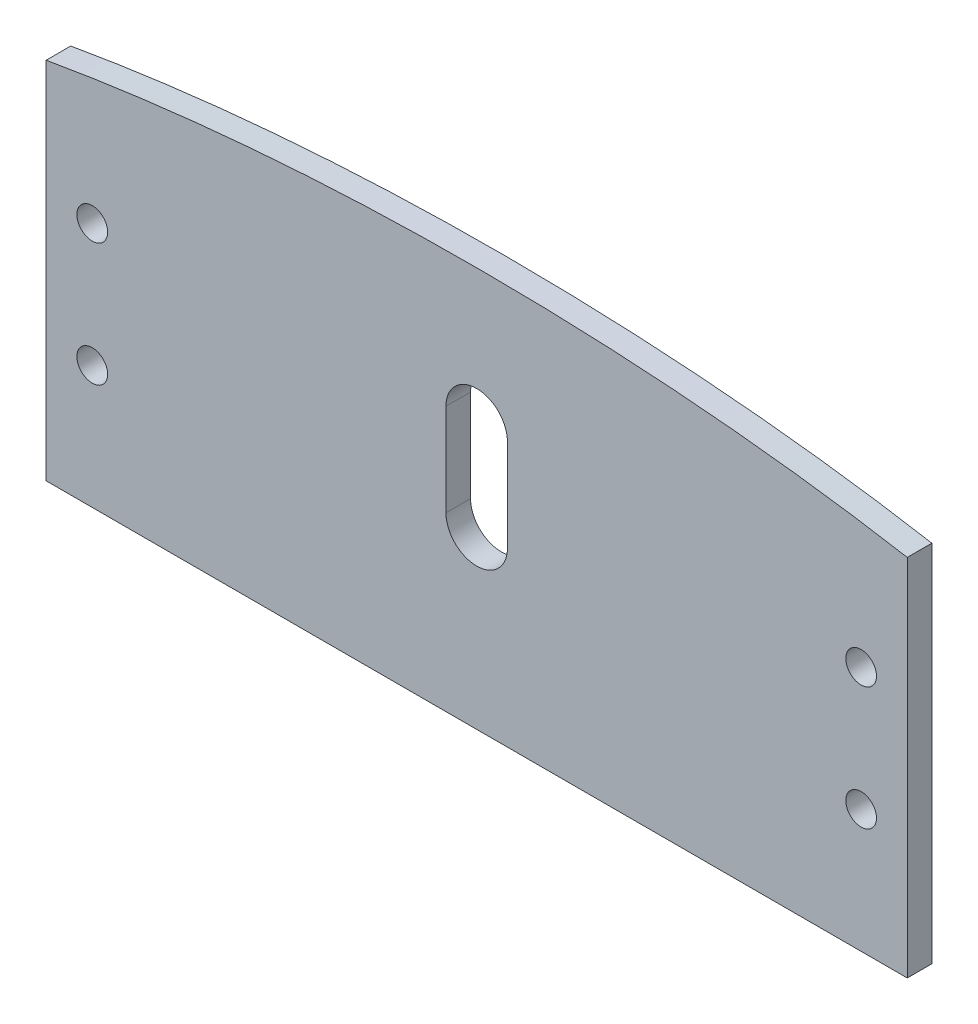
ISO-10303-21;
HEADER;
FILE_DESCRIPTION(('STEP AP214'),'2;1');
FILE_NAME('part.step','',(''),(''),'','','');
FILE_SCHEMA(('AUTOMOTIVE_DESIGN { 1 0 10303 214 1 1 1 1 }'));
ENDSEC;
DATA;
#1=APPLICATION_CONTEXT('core data for automotive mechanical design processes');
#2=APPLICATION_PROTOCOL_DEFINITION('international standard','automotive_design',2000,#1);
#3=PRODUCT_CONTEXT('',#1,'mechanical');
#4=PRODUCT('Part','Part','',(#3));
#5=PRODUCT_RELATED_PRODUCT_CATEGORY('part','',(#4));
#6=PRODUCT_DEFINITION_FORMATION('','',#4);
#7=PRODUCT_DEFINITION_CONTEXT('part definition',#1,'design');
#8=PRODUCT_DEFINITION('design','',#6,#7);
#9=PRODUCT_DEFINITION_SHAPE('','',#8);
#10=(LENGTH_UNIT() NAMED_UNIT(*) SI_UNIT(.MILLI.,.METRE.));
#11=(NAMED_UNIT(*) PLANE_ANGLE_UNIT() SI_UNIT($,.RADIAN.));
#12=(NAMED_UNIT(*) SI_UNIT($,.STERADIAN.) SOLID_ANGLE_UNIT());
#13=UNCERTAINTY_MEASURE_WITH_UNIT(LENGTH_MEASURE(1.E-05),#10,'distance_accuracy_value','');
#14=(GEOMETRIC_REPRESENTATION_CONTEXT(3) GLOBAL_UNCERTAINTY_ASSIGNED_CONTEXT((#13)) GLOBAL_UNIT_ASSIGNED_CONTEXT((#10,
#11,#12)) REPRESENTATION_CONTEXT('',''));
#15=CARTESIAN_POINT('',(0.,0.,0.));
#16=DIRECTION('',(0.,0.,1.));
#17=DIRECTION('',(1.,0.,0.));
#18=AXIS2_PLACEMENT_3D('',#15,#16,#17);
#19=CARTESIAN_POINT('',(70.,0.,0.));
#20=DIRECTION('',(-1.,0.,0.));
#21=DIRECTION('',(0.,-1.,0.));
#22=AXIS2_PLACEMENT_3D('',#19,#20,#21);
#23=PLANE('',#22);
#24=DIRECTION('',(0.,0.,-1.));
#25=VECTOR('',#24,1.);
#26=CARTESIAN_POINT('',(70.,44.2216638714053,4.));
#27=LINE('',#26,#25);
#28=CARTESIAN_POINT('',(70.,44.2216638714053,4.));
#29=VERTEX_POINT('',#28);
#30=CARTESIAN_POINT('',(70.,44.2216638714053,0.));
#31=VERTEX_POINT('',#30);
#32=EDGE_CURVE('E111',#29,#31,#27,.T.);
#33=ORIENTED_EDGE('',*,*,#32,.F.);
#34=DIRECTION('',(0.,-1.,0.));
#35=VECTOR('',#34,1.);
#36=CARTESIAN_POINT('',(70.,0.,4.));
#37=LINE('',#36,#35);
#38=CARTESIAN_POINT('',(70.,-15.,4.));
#39=VERTEX_POINT('',#38);
#40=EDGE_CURVE('E115',#29,#39,#37,.T.);
#41=ORIENTED_EDGE('',*,*,#40,.T.);
#42=DIRECTION('',(0.,0.,-1.));
#43=VECTOR('',#42,1.);
#44=CARTESIAN_POINT('',(70.,-15.,0.));
#45=LINE('',#44,#43);
#46=CARTESIAN_POINT('',(70.,-15.,0.));
#47=VERTEX_POINT('',#46);
#48=EDGE_CURVE('E37',#39,#47,#45,.T.);
#49=ORIENTED_EDGE('',*,*,#48,.T.);
#50=DIRECTION('',(0.,-1.,0.));
#51=VECTOR('',#50,1.);
#52=CARTESIAN_POINT('',(70.,0.,0.));
#53=LINE('',#52,#51);
#54=EDGE_CURVE('E101',#31,#47,#53,.T.);
#55=ORIENTED_EDGE('',*,*,#54,.F.);
#56=EDGE_LOOP('',(#33,#41,#49,#55));
#57=FACE_BOUND('',#56,.T.);
#58=ADVANCED_FACE('F33',(#57),#23,.F.);
#59=CARTESIAN_POINT('',(-70.,0.,0.));
#60=DIRECTION('',(-1.,0.,0.));
#61=DIRECTION('',(0.,-1.,0.));
#62=AXIS2_PLACEMENT_3D('',#59,#60,#61);
#63=PLANE('',#62);
#64=DIRECTION('',(0.,0.,-1.));
#65=VECTOR('',#64,1.);
#66=CARTESIAN_POINT('',(-70.,44.2216638714053,4.));
#67=LINE('',#66,#65);
#68=CARTESIAN_POINT('',(-70.,44.2216638714053,4.));
#69=VERTEX_POINT('',#68);
#70=CARTESIAN_POINT('',(-70.,44.2216638714053,0.));
#71=VERTEX_POINT('',#70);
#72=EDGE_CURVE('E140',#69,#71,#67,.T.);
#73=ORIENTED_EDGE('',*,*,#72,.T.);
#74=DIRECTION('',(0.,-1.,0.));
#75=VECTOR('',#74,1.);
#76=CARTESIAN_POINT('',(-70.,0.,0.));
#77=LINE('',#76,#75);
#78=CARTESIAN_POINT('',(-70.,-15.,0.));
#79=VERTEX_POINT('',#78);
#80=EDGE_CURVE('E112',#71,#79,#77,.T.);
#81=ORIENTED_EDGE('',*,*,#80,.T.);
#82=DIRECTION('',(0.,0.,-1.));
#83=VECTOR('',#82,1.);
#84=CARTESIAN_POINT('',(-70.,-15.,0.));
#85=LINE('',#84,#83);
#86=CARTESIAN_POINT('',(-70.,-15.,4.));
#87=VERTEX_POINT('',#86);
#88=EDGE_CURVE('E119',#87,#79,#85,.T.);
#89=ORIENTED_EDGE('',*,*,#88,.F.);
#90=DIRECTION('',(0.,-1.,0.));
#91=VECTOR('',#90,1.);
#92=CARTESIAN_POINT('',(-70.,0.,4.));
#93=LINE('',#92,#91);
#94=EDGE_CURVE('E146',#69,#87,#93,.T.);
#95=ORIENTED_EDGE('',*,*,#94,.F.);
#96=EDGE_LOOP('',(#73,#81,#89,#95));
#97=FACE_BOUND('',#96,.T.);
#98=ADVANCED_FACE('F215',(#97),#63,.T.);
#99=CARTESIAN_POINT('',(-5.,28.,-26.9258240356725));
#100=DIRECTION('',(-1.,0.,0.));
#101=DIRECTION('',(0.,-1.,0.));
#102=AXIS2_PLACEMENT_3D('',#99,#100,#101);
#103=PLANE('',#102);
#104=DIRECTION('',(0.,1.,0.));
#105=VECTOR('',#104,1.);
#106=CARTESIAN_POINT('',(-5.,28.,0.));
#107=LINE('',#106,#105);
#108=CARTESIAN_POINT('',(-5.,13.,0.));
#109=VERTEX_POINT('',#108);
#110=CARTESIAN_POINT('',(-5.,28.,0.));
#111=VERTEX_POINT('',#110);
#112=EDGE_CURVE('E132',#109,#111,#107,.T.);
#113=ORIENTED_EDGE('',*,*,#112,.T.);
#114=DIRECTION('',(0.,0.,1.));
#115=VECTOR('',#114,1.);
#116=CARTESIAN_POINT('',(-5.,28.,-26.9258240356725));
#117=LINE('',#116,#115);
#118=CARTESIAN_POINT('',(-5.,28.,4.));
#119=VERTEX_POINT('',#118);
#120=EDGE_CURVE('E180',#111,#119,#117,.T.);
#121=ORIENTED_EDGE('',*,*,#120,.T.);
#122=DIRECTION('',(0.,-1.,0.));
#123=VECTOR('',#122,1.);
#124=CARTESIAN_POINT('',(-5.,28.,4.));
#125=LINE('',#124,#123);
#126=CARTESIAN_POINT('',(-5.,13.,4.));
#127=VERTEX_POINT('',#126);
#128=EDGE_CURVE('E174',#119,#127,#125,.T.);
#129=ORIENTED_EDGE('',*,*,#128,.T.);
#130=DIRECTION('',(0.,0.,1.));
#131=VECTOR('',#130,1.);
#132=CARTESIAN_POINT('',(-5.,13.,-26.9258240356725));
#133=LINE('',#132,#131);
#134=EDGE_CURVE('E50',#109,#127,#133,.T.);
#135=ORIENTED_EDGE('',*,*,#134,.F.);
#136=EDGE_LOOP('',(#113,#121,#129,#135));
#137=FACE_BOUND('',#136,.T.);
#138=ADVANCED_FACE('F187',(#137),#103,.F.);
#139=CARTESIAN_POINT('',(0.,13.,-26.9258240356725));
#140=DIRECTION('',(0.,0.,1.));
#141=DIRECTION('',(1.,0.,0.));
#142=AXIS2_PLACEMENT_3D('',#139,#140,#141);
#143=CYLINDRICAL_SURFACE('',#142,5.);
#144=CARTESIAN_POINT('',(0.,13.,0.));
#145=DIRECTION('',(0.,0.,1.));
#146=DIRECTION('',(1.,0.,0.));
#147=AXIS2_PLACEMENT_3D('',#144,#145,#146);
#148=CIRCLE('',#147,5.);
#149=CARTESIAN_POINT('',(5.,13.,0.));
#150=VERTEX_POINT('',#149);
#151=EDGE_CURVE('E166',#150,#109,#148,.F.);
#152=ORIENTED_EDGE('',*,*,#151,.T.);
#153=ORIENTED_EDGE('',*,*,#134,.T.);
#154=CARTESIAN_POINT('',(0.,13.,4.));
#155=DIRECTION('',(0.,0.,1.));
#156=DIRECTION('',(1.,0.,0.));
#157=AXIS2_PLACEMENT_3D('',#154,#155,#156);
#158=CIRCLE('',#157,5.);
#159=CARTESIAN_POINT('',(5.,13.,4.));
#160=VERTEX_POINT('',#159);
#161=EDGE_CURVE('E176',#127,#160,#158,.T.);
#162=ORIENTED_EDGE('',*,*,#161,.T.);
#163=DIRECTION('',(0.,0.,1.));
#164=VECTOR('',#163,1.);
#165=CARTESIAN_POINT('',(5.,13.,-26.9258240356725));
#166=LINE('',#165,#164);
#167=EDGE_CURVE('E58',#150,#160,#166,.T.);
#168=ORIENTED_EDGE('',*,*,#167,.F.);
#169=EDGE_LOOP('',(#152,#153,#162,#168));
#170=FACE_BOUND('',#169,.T.);
#171=ADVANCED_FACE('F196',(#170),#143,.F.);
#172=CARTESIAN_POINT('',(5.,28.,-26.9258240356725));
#173=DIRECTION('',(1.,0.,0.));
#174=DIRECTION('',(0.,1.,0.));
#175=AXIS2_PLACEMENT_3D('',#172,#173,#174);
#176=PLANE('',#175);
#177=DIRECTION('',(0.,-1.,0.));
#178=VECTOR('',#177,1.);
#179=CARTESIAN_POINT('',(5.,28.,0.));
#180=LINE('',#179,#178);
#181=CARTESIAN_POINT('',(5.,28.,0.));
#182=VERTEX_POINT('',#181);
#183=EDGE_CURVE('E169',#182,#150,#180,.T.);
#184=ORIENTED_EDGE('',*,*,#183,.T.);
#185=ORIENTED_EDGE('',*,*,#167,.T.);
#186=DIRECTION('',(0.,1.,0.));
#187=VECTOR('',#186,1.);
#188=CARTESIAN_POINT('',(5.,28.,4.));
#189=LINE('',#188,#187);
#190=CARTESIAN_POINT('',(5.,28.,4.));
#191=VERTEX_POINT('',#190);
#192=EDGE_CURVE('E178',#160,#191,#189,.T.);
#193=ORIENTED_EDGE('',*,*,#192,.T.);
#194=DIRECTION('',(0.,0.,1.));
#195=VECTOR('',#194,1.);
#196=CARTESIAN_POINT('',(5.,28.,-26.9258240356725));
#197=LINE('',#196,#195);
#198=EDGE_CURVE('E168',#182,#191,#197,.T.);
#199=ORIENTED_EDGE('',*,*,#198,.F.);
#200=EDGE_LOOP('',(#184,#185,#193,#199));
#201=FACE_BOUND('',#200,.T.);
#202=ADVANCED_FACE('F203',(#201),#176,.F.);
#203=CARTESIAN_POINT('',(0.,28.,-26.9258240356725));
#204=DIRECTION('',(0.,0.,1.));
#205=DIRECTION('',(1.,0.,0.));
#206=AXIS2_PLACEMENT_3D('',#203,#204,#205);
#207=CYLINDRICAL_SURFACE('',#206,5.);
#208=CARTESIAN_POINT('',(0.,28.,0.));
#209=DIRECTION('',(0.,0.,1.));
#210=DIRECTION('',(1.,0.,0.));
#211=AXIS2_PLACEMENT_3D('',#208,#209,#210);
#212=CIRCLE('',#211,5.);
#213=EDGE_CURVE('E171',#111,#182,#212,.F.);
#214=ORIENTED_EDGE('',*,*,#213,.T.);
#215=ORIENTED_EDGE('',*,*,#198,.T.);
#216=CARTESIAN_POINT('',(0.,28.,4.));
#217=DIRECTION('',(0.,0.,1.));
#218=DIRECTION('',(1.,0.,0.));
#219=AXIS2_PLACEMENT_3D('',#216,#217,#218);
#220=CIRCLE('',#219,5.);
#221=EDGE_CURVE('E127',#191,#119,#220,.T.);
#222=ORIENTED_EDGE('',*,*,#221,.T.);
#223=ORIENTED_EDGE('',*,*,#120,.F.);
#224=EDGE_LOOP('',(#214,#215,#222,#223));
#225=FACE_BOUND('',#224,.T.);
#226=ADVANCED_FACE('F202',(#225),#207,.F.);
#227=CARTESIAN_POINT('',(-62.5,5.,11.0710678118655));
#228=DIRECTION('',(0.,0.,-1.));
#229=DIRECTION('',(-1.,0.,0.));
#230=AXIS2_PLACEMENT_3D('',#227,#228,#229);
#231=CYLINDRICAL_SURFACE('',#230,2.5);
#232=CARTESIAN_POINT('',(-62.5,5.,4.));
#233=DIRECTION('',(0.,0.,1.));
#234=DIRECTION('',(1.,0.,0.));
#235=AXIS2_PLACEMENT_3D('',#232,#233,#234);
#236=CIRCLE('',#235,2.5);
#237=CARTESIAN_POINT('',(-60.,5.,4.));
#238=VERTEX_POINT('',#237);
#239=EDGE_CURVE('E11',#238,#238,#236,.F.);
#240=ORIENTED_EDGE('',*,*,#239,.F.);
#241=EDGE_LOOP('',(#240));
#242=FACE_BOUND('',#241,.T.);
#243=CARTESIAN_POINT('',(-62.5,5.,0.));
#244=DIRECTION('',(0.,0.,1.));
#245=DIRECTION('',(1.,0.,0.));
#246=AXIS2_PLACEMENT_3D('',#243,#244,#245);
#247=CIRCLE('',#246,2.5);
#248=CARTESIAN_POINT('',(-60.,5.,0.));
#249=VERTEX_POINT('',#248);
#250=EDGE_CURVE('E154',#249,#249,#247,.T.);
#251=ORIENTED_EDGE('',*,*,#250,.F.);
#252=EDGE_LOOP('',(#251));
#253=FACE_BOUND('',#252,.T.);
#254=ADVANCED_FACE('F210',(#242,#253),#231,.F.);
#255=CARTESIAN_POINT('',(62.5,5.00000000000002,11.0710678118655));
#256=DIRECTION('',(0.,0.,-1.));
#257=DIRECTION('',(-1.,0.,0.));
#258=AXIS2_PLACEMENT_3D('',#255,#256,#257);
#259=CYLINDRICAL_SURFACE('',#258,2.5);
#260=CARTESIAN_POINT('',(62.5,5.00000000000002,4.));
#261=DIRECTION('',(0.,0.,1.));
#262=DIRECTION('',(1.,0.,0.));
#263=AXIS2_PLACEMENT_3D('',#260,#261,#262);
#264=CIRCLE('',#263,2.5);
#265=CARTESIAN_POINT('',(65.,5.00000000000002,4.));
#266=VERTEX_POINT('',#265);
#267=EDGE_CURVE('E42',#266,#266,#264,.F.);
#268=ORIENTED_EDGE('',*,*,#267,.F.);
#269=EDGE_LOOP('',(#268));
#270=FACE_BOUND('',#269,.T.);
#271=CARTESIAN_POINT('',(62.5,5.00000000000002,0.));
#272=DIRECTION('',(0.,0.,1.));
#273=DIRECTION('',(1.,0.,0.));
#274=AXIS2_PLACEMENT_3D('',#271,#272,#273);
#275=CIRCLE('',#274,2.5);
#276=CARTESIAN_POINT('',(65.,5.00000000000002,0.));
#277=VERTEX_POINT('',#276);
#278=EDGE_CURVE('E161',#277,#277,#275,.T.);
#279=ORIENTED_EDGE('',*,*,#278,.F.);
#280=EDGE_LOOP('',(#279));
#281=FACE_BOUND('',#280,.T.);
#282=ADVANCED_FACE('F250',(#270,#281),#259,.F.);
#283=CARTESIAN_POINT('',(-62.5,25.,11.0710678118655));
#284=DIRECTION('',(0.,0.,-1.));
#285=DIRECTION('',(-1.,0.,0.));
#286=AXIS2_PLACEMENT_3D('',#283,#284,#285);
#287=CYLINDRICAL_SURFACE('',#286,2.5);
#288=CARTESIAN_POINT('',(-62.5,25.,4.));
#289=DIRECTION('',(0.,0.,1.));
#290=DIRECTION('',(1.,0.,0.));
#291=AXIS2_PLACEMENT_3D('',#288,#289,#290);
#292=CIRCLE('',#291,2.5);
#293=CARTESIAN_POINT('',(-60.,25.,4.));
#294=VERTEX_POINT('',#293);
#295=EDGE_CURVE('E153',#294,#294,#292,.F.);
#296=ORIENTED_EDGE('',*,*,#295,.F.);
#297=EDGE_LOOP('',(#296));
#298=FACE_BOUND('',#297,.T.);
#299=CARTESIAN_POINT('',(-62.5,25.,0.));
#300=DIRECTION('',(0.,0.,1.));
#301=DIRECTION('',(1.,0.,0.));
#302=AXIS2_PLACEMENT_3D('',#299,#300,#301);
#303=CIRCLE('',#302,2.5);
#304=CARTESIAN_POINT('',(-60.,25.,0.));
#305=VERTEX_POINT('',#304);
#306=EDGE_CURVE('E125',#305,#305,#303,.T.);
#307=ORIENTED_EDGE('',*,*,#306,.F.);
#308=EDGE_LOOP('',(#307));
#309=FACE_BOUND('',#308,.T.);
#310=ADVANCED_FACE('F259',(#298,#309),#287,.F.);
#311=CARTESIAN_POINT('',(62.5,25.,11.0710678118655));
#312=DIRECTION('',(0.,0.,-1.));
#313=DIRECTION('',(-1.,0.,0.));
#314=AXIS2_PLACEMENT_3D('',#311,#312,#313);
#315=CYLINDRICAL_SURFACE('',#314,2.5);
#316=CARTESIAN_POINT('',(62.5,25.,4.));
#317=DIRECTION('',(0.,0.,1.));
#318=DIRECTION('',(1.,0.,0.));
#319=AXIS2_PLACEMENT_3D('',#316,#317,#318);
#320=CIRCLE('',#319,2.5);
#321=CARTESIAN_POINT('',(65.,25.,4.));
#322=VERTEX_POINT('',#321);
#323=EDGE_CURVE('E150',#322,#322,#320,.F.);
#324=ORIENTED_EDGE('',*,*,#323,.F.);
#325=EDGE_LOOP('',(#324));
#326=FACE_BOUND('',#325,.T.);
#327=CARTESIAN_POINT('',(62.5,25.,0.));
#328=DIRECTION('',(0.,0.,1.));
#329=DIRECTION('',(1.,0.,0.));
#330=AXIS2_PLACEMENT_3D('',#327,#328,#329);
#331=CIRCLE('',#330,2.5);
#332=CARTESIAN_POINT('',(65.,25.,0.));
#333=VERTEX_POINT('',#332);
#334=EDGE_CURVE('E121',#333,#333,#331,.T.);
#335=ORIENTED_EDGE('',*,*,#334,.F.);
#336=EDGE_LOOP('',(#335));
#337=FACE_BOUND('',#336,.T.);
#338=ADVANCED_FACE('F269',(#326,#337),#315,.F.);
#339=CARTESIAN_POINT('',(0.,0.,4.));
#340=DIRECTION('',(0.,0.,1.));
#341=DIRECTION('',(1.,0.,0.));
#342=AXIS2_PLACEMENT_3D('',#339,#340,#341);
#343=ELLIPSE('',#342,150.,50.);
#344=DIRECTION('',(0.,0.,-1.));
#345=VECTOR('',#344,1.);
#346=SURFACE_OF_LINEAR_EXTRUSION('',#343,#345);
#347=EDGE_CURVE('E136',#29,#69,#343,.T.);
#348=ORIENTED_EDGE('',*,*,#347,.F.);
#349=ORIENTED_EDGE('',*,*,#32,.T.);
#350=CARTESIAN_POINT('',(0.,0.,0.));
#351=DIRECTION('',(0.,0.,1.));
#352=DIRECTION('',(1.,0.,0.));
#353=AXIS2_PLACEMENT_3D('',#350,#351,#352);
#354=ELLIPSE('',#353,150.,50.);
#355=EDGE_CURVE('E107',#31,#71,#354,.T.);
#356=ORIENTED_EDGE('',*,*,#355,.T.);
#357=ORIENTED_EDGE('',*,*,#72,.F.);
#358=EDGE_LOOP('',(#348,#349,#356,#357));
#359=FACE_BOUND('',#358,.T.);
#360=ADVANCED_FACE('F279',(#359),#346,.F.);
#361=CARTESIAN_POINT('',(0.,0.,0.));
#362=DIRECTION('',(0.,0.,1.));
#363=DIRECTION('',(1.,0.,0.));
#364=AXIS2_PLACEMENT_3D('',#361,#362,#363);
#365=PLANE('',#364);
#366=ORIENTED_EDGE('',*,*,#183,.F.);
#367=ORIENTED_EDGE('',*,*,#213,.F.);
#368=ORIENTED_EDGE('',*,*,#112,.F.);
#369=ORIENTED_EDGE('',*,*,#151,.F.);
#370=EDGE_LOOP('',(#366,#367,#368,#369));
#371=FACE_BOUND('',#370,.T.);
#372=ORIENTED_EDGE('',*,*,#250,.T.);
#373=EDGE_LOOP('',(#372));
#374=FACE_BOUND('',#373,.T.);
#375=ORIENTED_EDGE('',*,*,#278,.T.);
#376=EDGE_LOOP('',(#375));
#377=FACE_BOUND('',#376,.T.);
#378=ORIENTED_EDGE('',*,*,#306,.T.);
#379=EDGE_LOOP('',(#378));
#380=FACE_BOUND('',#379,.T.);
#381=ORIENTED_EDGE('',*,*,#334,.T.);
#382=EDGE_LOOP('',(#381));
#383=FACE_BOUND('',#382,.T.);
#384=ORIENTED_EDGE('',*,*,#355,.F.);
#385=ORIENTED_EDGE('',*,*,#54,.T.);
#386=DIRECTION('',(1.,0.,0.));
#387=VECTOR('',#386,1.);
#388=CARTESIAN_POINT('',(-150.,-15.,0.));
#389=LINE('',#388,#387);
#390=EDGE_CURVE('E106',#79,#47,#389,.T.);
#391=ORIENTED_EDGE('',*,*,#390,.F.);
#392=ORIENTED_EDGE('',*,*,#80,.F.);
#393=EDGE_LOOP('',(#384,#385,#391,#392));
#394=FACE_BOUND('',#393,.T.);
#395=ADVANCED_FACE('F103',(#371,#374,#377,#380,#383,#394),#365,.F.);
#396=CARTESIAN_POINT('',(0.,0.,4.));
#397=DIRECTION('',(0.,0.,1.));
#398=DIRECTION('',(1.,0.,0.));
#399=AXIS2_PLACEMENT_3D('',#396,#397,#398);
#400=PLANE('',#399);
#401=ORIENTED_EDGE('',*,*,#40,.F.);
#402=ORIENTED_EDGE('',*,*,#347,.T.);
#403=ORIENTED_EDGE('',*,*,#94,.T.);
#404=DIRECTION('',(-1.,0.,0.));
#405=VECTOR('',#404,1.);
#406=CARTESIAN_POINT('',(-150.,-15.,4.));
#407=LINE('',#406,#405);
#408=EDGE_CURVE('E122',#39,#87,#407,.T.);
#409=ORIENTED_EDGE('',*,*,#408,.F.);
#410=EDGE_LOOP('',(#401,#402,#403,#409));
#411=FACE_BOUND('',#410,.T.);
#412=ORIENTED_EDGE('',*,*,#323,.T.);
#413=EDGE_LOOP('',(#412));
#414=FACE_BOUND('',#413,.T.);
#415=ORIENTED_EDGE('',*,*,#295,.T.);
#416=EDGE_LOOP('',(#415));
#417=FACE_BOUND('',#416,.T.);
#418=ORIENTED_EDGE('',*,*,#267,.T.);
#419=EDGE_LOOP('',(#418));
#420=FACE_BOUND('',#419,.T.);
#421=ORIENTED_EDGE('',*,*,#239,.T.);
#422=EDGE_LOOP('',(#421));
#423=FACE_BOUND('',#422,.T.);
#424=ORIENTED_EDGE('',*,*,#221,.F.);
#425=ORIENTED_EDGE('',*,*,#192,.F.);
#426=ORIENTED_EDGE('',*,*,#161,.F.);
#427=ORIENTED_EDGE('',*,*,#128,.F.);
#428=EDGE_LOOP('',(#424,#425,#426,#427));
#429=FACE_BOUND('',#428,.T.);
#430=ADVANCED_FACE('F194',(#411,#414,#417,#420,#423,#429),#400,.T.);
#431=CARTESIAN_POINT('',(0.,-15.,0.));
#432=DIRECTION('',(0.,-1.,0.));
#433=DIRECTION('',(0.,0.,-1.));
#434=AXIS2_PLACEMENT_3D('',#431,#432,#433);
#435=PLANE('',#434);
#436=ORIENTED_EDGE('',*,*,#48,.F.);
#437=ORIENTED_EDGE('',*,*,#408,.T.);
#438=ORIENTED_EDGE('',*,*,#88,.T.);
#439=ORIENTED_EDGE('',*,*,#390,.T.);
#440=EDGE_LOOP('',(#436,#437,#438,#439));
#441=FACE_BOUND('',#440,.T.);
#442=ADVANCED_FACE('F35',(#441),#435,.T.);
#443=CLOSED_SHELL('',(#58,#98,#138,#171,#202,#226,#254,#282,#310,#338,#360,#395,#430,#442));
#444=MANIFOLD_SOLID_BREP('B2',#443);
#445=ADVANCED_BREP_SHAPE_REPRESENTATION('',(#18,#444),#14);
#446=SHAPE_DEFINITION_REPRESENTATION(#9,#445);
ENDSEC;
END-ISO-10303-21;
